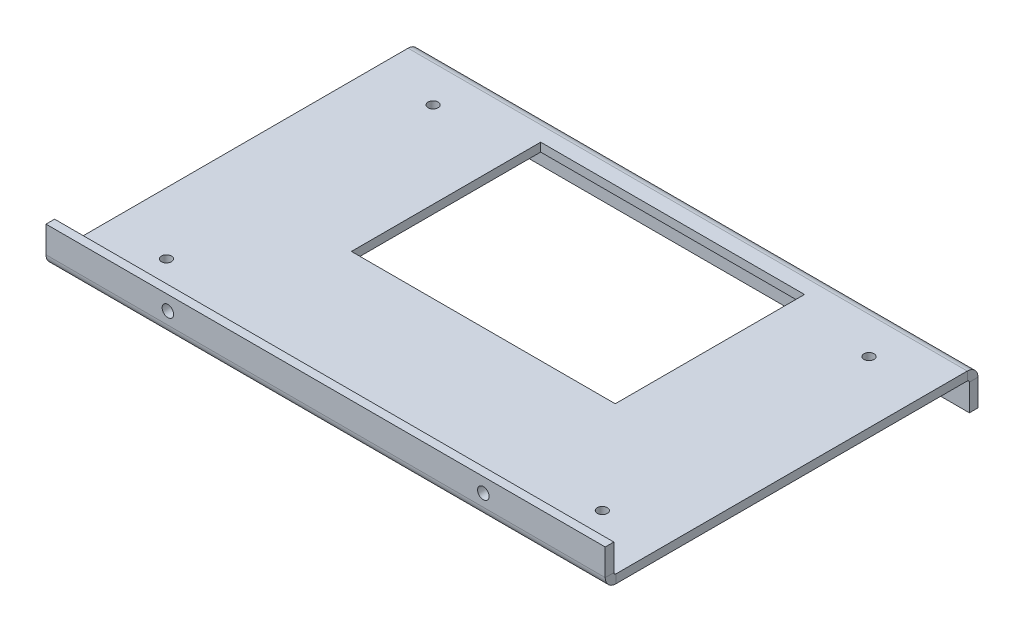
ISO-10303-21;
HEADER;
FILE_DESCRIPTION(('STEP AP214'),'2;1');
FILE_NAME('part.step','',(''),(''),'','','');
FILE_SCHEMA(('AUTOMOTIVE_DESIGN { 1 0 10303 214 1 1 1 1 }'));
ENDSEC;
DATA;
#1=APPLICATION_CONTEXT('core data for automotive mechanical design processes');
#2=APPLICATION_PROTOCOL_DEFINITION('international standard','automotive_design',2000,#1);
#3=PRODUCT_CONTEXT('',#1,'mechanical');
#4=PRODUCT('Part','Part','',(#3));
#5=PRODUCT_RELATED_PRODUCT_CATEGORY('part','',(#4));
#6=PRODUCT_DEFINITION_FORMATION('','',#4);
#7=PRODUCT_DEFINITION_CONTEXT('part definition',#1,'design');
#8=PRODUCT_DEFINITION('design','',#6,#7);
#9=PRODUCT_DEFINITION_SHAPE('','',#8);
#10=(LENGTH_UNIT() NAMED_UNIT(*) SI_UNIT(.MILLI.,.METRE.));
#11=(NAMED_UNIT(*) PLANE_ANGLE_UNIT() SI_UNIT($,.RADIAN.));
#12=(NAMED_UNIT(*) SI_UNIT($,.STERADIAN.) SOLID_ANGLE_UNIT());
#13=UNCERTAINTY_MEASURE_WITH_UNIT(LENGTH_MEASURE(1.E-05),#10,'distance_accuracy_value','');
#14=(GEOMETRIC_REPRESENTATION_CONTEXT(3) GLOBAL_UNCERTAINTY_ASSIGNED_CONTEXT((#13)) GLOBAL_UNIT_ASSIGNED_CONTEXT((#10,
#11,#12)) REPRESENTATION_CONTEXT('',''));
#15=CARTESIAN_POINT('',(0.,0.,0.));
#16=DIRECTION('',(0.,0.,1.));
#17=DIRECTION('',(1.,0.,0.));
#18=AXIS2_PLACEMENT_3D('',#15,#16,#17);
#19=CARTESIAN_POINT('',(97.5,-3.,65.));
#20=DIRECTION('',(1.,0.,0.));
#21=DIRECTION('',(0.,0.,-1.));
#22=AXIS2_PLACEMENT_3D('',#19,#20,#21);
#23=PLANE('',#22);
#24=DIRECTION('',(0.,0.,-1.));
#25=VECTOR('',#24,1.);
#26=CARTESIAN_POINT('',(97.5,-3.,65.));
#27=LINE('',#26,#25);
#28=CARTESIAN_POINT('',(97.5,-2.99999999999999,61.2634));
#29=VERTEX_POINT('',#28);
#30=CARTESIAN_POINT('',(97.5,-3.,-61.2634));
#31=VERTEX_POINT('',#30);
#32=EDGE_CURVE('E90',#29,#31,#27,.T.);
#33=ORIENTED_EDGE('',*,*,#32,.T.);
#34=DIRECTION('',(0.,1.,0.));
#35=VECTOR('',#34,1.);
#36=CARTESIAN_POINT('',(97.5,-3.00000000000001,-61.2634));
#37=LINE('',#36,#35);
#38=CARTESIAN_POINT('',(97.5,0.,-61.2634));
#39=VERTEX_POINT('',#38);
#40=EDGE_CURVE('E321',#31,#39,#37,.T.);
#41=ORIENTED_EDGE('',*,*,#40,.T.);
#42=DIRECTION('',(0.,0.,-1.));
#43=VECTOR('',#42,1.);
#44=CARTESIAN_POINT('',(97.5,0.,65.));
#45=LINE('',#44,#43);
#46=CARTESIAN_POINT('',(97.5,0.,61.2634));
#47=VERTEX_POINT('',#46);
#48=EDGE_CURVE('E414',#47,#39,#45,.T.);
#49=ORIENTED_EDGE('',*,*,#48,.F.);
#50=DIRECTION('',(0.,-1.,0.));
#51=VECTOR('',#50,1.);
#52=CARTESIAN_POINT('',(97.5,0.,61.2634));
#53=LINE('',#52,#51);
#54=EDGE_CURVE('E395',#47,#29,#53,.T.);
#55=ORIENTED_EDGE('',*,*,#54,.T.);
#56=EDGE_LOOP('',(#33,#41,#49,#55));
#57=FACE_BOUND('',#56,.T.);
#58=ADVANCED_FACE('F81',(#57),#23,.T.);
#59=CARTESIAN_POINT('',(0.,-3.,0.));
#60=DIRECTION('',(0.,-1.,0.));
#61=DIRECTION('',(0.,0.,-1.));
#62=AXIS2_PLACEMENT_3D('',#59,#60,#61);
#63=PLANE('',#62);
#64=DIRECTION('',(0.,0.,1.));
#65=VECTOR('',#64,1.);
#66=CARTESIAN_POINT('',(-46.,-3.,9.99999999999999));
#67=LINE('',#66,#65);
#68=CARTESIAN_POINT('',(-46.,-3.,-56.));
#69=VERTEX_POINT('',#68);
#70=CARTESIAN_POINT('',(-46.,-3.,9.99999999999999));
#71=VERTEX_POINT('',#70);
#72=EDGE_CURVE('E206',#69,#71,#67,.T.);
#73=ORIENTED_EDGE('',*,*,#72,.T.);
#74=DIRECTION('',(1.,0.,0.));
#75=VECTOR('',#74,1.);
#76=CARTESIAN_POINT('',(46.,-3.,9.99999999999998));
#77=LINE('',#76,#75);
#78=CARTESIAN_POINT('',(46.,-3.,9.99999999999998));
#79=VERTEX_POINT('',#78);
#80=EDGE_CURVE('E194',#71,#79,#77,.T.);
#81=ORIENTED_EDGE('',*,*,#80,.T.);
#82=DIRECTION('',(0.,0.,-1.));
#83=VECTOR('',#82,1.);
#84=CARTESIAN_POINT('',(46.,-3.,9.99999999999998));
#85=LINE('',#84,#83);
#86=CARTESIAN_POINT('',(46.,-3.,-56.));
#87=VERTEX_POINT('',#86);
#88=EDGE_CURVE('E221',#79,#87,#85,.T.);
#89=ORIENTED_EDGE('',*,*,#88,.T.);
#90=DIRECTION('',(-1.,0.,0.));
#91=VECTOR('',#90,1.);
#92=CARTESIAN_POINT('',(46.,-3.,-56.));
#93=LINE('',#92,#91);
#94=EDGE_CURVE('E214',#87,#69,#93,.T.);
#95=ORIENTED_EDGE('',*,*,#94,.T.);
#96=EDGE_LOOP('',(#73,#81,#89,#95));
#97=FACE_BOUND('',#96,.T.);
#98=CARTESIAN_POINT('',(-76.,-3.,44.5));
#99=DIRECTION('',(0.,-1.,0.));
#100=DIRECTION('',(0.,0.,-1.));
#101=AXIS2_PLACEMENT_3D('',#98,#99,#100);
#102=CIRCLE('',#101,1.74999999999998);
#103=CARTESIAN_POINT('',(-76.,-3.,42.75));
#104=VERTEX_POINT('',#103);
#105=EDGE_CURVE('E202',#104,#104,#102,.F.);
#106=ORIENTED_EDGE('',*,*,#105,.T.);
#107=EDGE_LOOP('',(#106));
#108=FACE_BOUND('',#107,.T.);
#109=CARTESIAN_POINT('',(75.9999999999999,-3.,44.5));
#110=DIRECTION('',(0.,-1.,0.));
#111=DIRECTION('',(0.,0.,-1.));
#112=AXIS2_PLACEMENT_3D('',#109,#110,#111);
#113=CIRCLE('',#112,1.75);
#114=CARTESIAN_POINT('',(75.9999999999999,-3.,42.75));
#115=VERTEX_POINT('',#114);
#116=EDGE_CURVE('E840',#115,#115,#113,.F.);
#117=ORIENTED_EDGE('',*,*,#116,.T.);
#118=EDGE_LOOP('',(#117));
#119=FACE_BOUND('',#118,.T.);
#120=CARTESIAN_POINT('',(76.,-3.,-48.5));
#121=DIRECTION('',(0.,-1.,0.));
#122=DIRECTION('',(0.,0.,-1.));
#123=AXIS2_PLACEMENT_3D('',#120,#121,#122);
#124=CIRCLE('',#123,1.75);
#125=CARTESIAN_POINT('',(76.,-3.,-50.25));
#126=VERTEX_POINT('',#125);
#127=EDGE_CURVE('E848',#126,#126,#124,.F.);
#128=ORIENTED_EDGE('',*,*,#127,.T.);
#129=EDGE_LOOP('',(#128));
#130=FACE_BOUND('',#129,.T.);
#131=CARTESIAN_POINT('',(-76.,-3.,-48.5));
#132=DIRECTION('',(0.,-1.,0.));
#133=DIRECTION('',(0.,0.,-1.));
#134=AXIS2_PLACEMENT_3D('',#131,#132,#133);
#135=CIRCLE('',#134,1.75);
#136=CARTESIAN_POINT('',(-76.,-3.,-50.25));
#137=VERTEX_POINT('',#136);
#138=EDGE_CURVE('E246',#137,#137,#135,.F.);
#139=ORIENTED_EDGE('',*,*,#138,.T.);
#140=EDGE_LOOP('',(#139));
#141=FACE_BOUND('',#140,.T.);
#142=DIRECTION('',(0.,0.,1.));
#143=VECTOR('',#142,1.);
#144=CARTESIAN_POINT('',(-97.5,-3.,65.));
#145=LINE('',#144,#143);
#146=CARTESIAN_POINT('',(-97.5,-3.,-61.2634));
#147=VERTEX_POINT('',#146);
#148=CARTESIAN_POINT('',(-97.5,-3.,61.2634));
#149=VERTEX_POINT('',#148);
#150=EDGE_CURVE('E13',#147,#149,#145,.T.);
#151=ORIENTED_EDGE('',*,*,#150,.F.);
#152=DIRECTION('',(1.,0.,0.));
#153=VECTOR('',#152,1.);
#154=CARTESIAN_POINT('',(97.5,-3.00000000000001,-61.2634));
#155=LINE('',#154,#153);
#156=EDGE_CURVE('E329',#31,#147,#155,.F.);
#157=ORIENTED_EDGE('',*,*,#156,.F.);
#158=ORIENTED_EDGE('',*,*,#32,.F.);
#159=DIRECTION('',(1.,0.,0.));
#160=VECTOR('',#159,1.);
#161=CARTESIAN_POINT('',(97.4999999999999,-2.99999999999999,61.2634));
#162=LINE('',#161,#160);
#163=EDGE_CURVE('E386',#29,#149,#162,.F.);
#164=ORIENTED_EDGE('',*,*,#163,.T.);
#165=EDGE_LOOP('',(#151,#157,#158,#164));
#166=FACE_BOUND('',#165,.T.);
#167=ADVANCED_FACE('F212',(#97,#108,#119,#130,#141,#166),#63,.T.);
#168=CARTESIAN_POINT('',(0.,0.,0.));
#169=DIRECTION('',(0.,-1.,0.));
#170=DIRECTION('',(0.,0.,-1.));
#171=AXIS2_PLACEMENT_3D('',#168,#169,#170);
#172=PLANE('',#171);
#173=DIRECTION('',(1.,0.,0.));
#174=VECTOR('',#173,1.);
#175=CARTESIAN_POINT('',(46.,0.,9.99999999999998));
#176=LINE('',#175,#174);
#177=CARTESIAN_POINT('',(-46.,0.,9.99999999999999));
#178=VERTEX_POINT('',#177);
#179=CARTESIAN_POINT('',(46.,0.,9.99999999999998));
#180=VERTEX_POINT('',#179);
#181=EDGE_CURVE('E219',#178,#180,#176,.T.);
#182=ORIENTED_EDGE('',*,*,#181,.F.);
#183=DIRECTION('',(0.,0.,1.));
#184=VECTOR('',#183,1.);
#185=CARTESIAN_POINT('',(-46.,0.,9.99999999999999));
#186=LINE('',#185,#184);
#187=CARTESIAN_POINT('',(-46.,0.,-56.));
#188=VERTEX_POINT('',#187);
#189=EDGE_CURVE('E106',#188,#178,#186,.T.);
#190=ORIENTED_EDGE('',*,*,#189,.F.);
#191=DIRECTION('',(-1.,0.,0.));
#192=VECTOR('',#191,1.);
#193=CARTESIAN_POINT('',(46.,0.,-56.));
#194=LINE('',#193,#192);
#195=CARTESIAN_POINT('',(46.,0.,-56.));
#196=VERTEX_POINT('',#195);
#197=EDGE_CURVE('E209',#196,#188,#194,.T.);
#198=ORIENTED_EDGE('',*,*,#197,.F.);
#199=DIRECTION('',(0.,0.,-1.));
#200=VECTOR('',#199,1.);
#201=CARTESIAN_POINT('',(46.,0.,9.99999999999998));
#202=LINE('',#201,#200);
#203=EDGE_CURVE('E227',#180,#196,#202,.T.);
#204=ORIENTED_EDGE('',*,*,#203,.F.);
#205=EDGE_LOOP('',(#182,#190,#198,#204));
#206=FACE_BOUND('',#205,.T.);
#207=CARTESIAN_POINT('',(-76.,0.,44.5));
#208=DIRECTION('',(0.,1.,0.));
#209=DIRECTION('',(0.,0.,-1.));
#210=AXIS2_PLACEMENT_3D('',#207,#208,#209);
#211=CIRCLE('',#210,1.74999999999998);
#212=CARTESIAN_POINT('',(-76.,0.,42.75));
#213=VERTEX_POINT('',#212);
#214=EDGE_CURVE('E836',#213,#213,#211,.T.);
#215=ORIENTED_EDGE('',*,*,#214,.F.);
#216=EDGE_LOOP('',(#215));
#217=FACE_BOUND('',#216,.T.);
#218=CARTESIAN_POINT('',(75.9999999999999,0.,44.5));
#219=DIRECTION('',(0.,1.,0.));
#220=DIRECTION('',(0.,0.,1.));
#221=AXIS2_PLACEMENT_3D('',#218,#219,#220);
#222=CIRCLE('',#221,1.75);
#223=CARTESIAN_POINT('',(75.9999999999999,0.,46.25));
#224=VERTEX_POINT('',#223);
#225=EDGE_CURVE('E844',#224,#224,#222,.T.);
#226=ORIENTED_EDGE('',*,*,#225,.F.);
#227=EDGE_LOOP('',(#226));
#228=FACE_BOUND('',#227,.T.);
#229=CARTESIAN_POINT('',(76.,0.,-48.5));
#230=DIRECTION('',(0.,1.,0.));
#231=DIRECTION('',(0.,0.,-1.));
#232=AXIS2_PLACEMENT_3D('',#229,#230,#231);
#233=CIRCLE('',#232,1.75);
#234=CARTESIAN_POINT('',(76.,0.,-50.25));
#235=VERTEX_POINT('',#234);
#236=EDGE_CURVE('E250',#235,#235,#233,.T.);
#237=ORIENTED_EDGE('',*,*,#236,.F.);
#238=EDGE_LOOP('',(#237));
#239=FACE_BOUND('',#238,.T.);
#240=CARTESIAN_POINT('',(-76.,0.,-48.5));
#241=DIRECTION('',(0.,1.,0.));
#242=DIRECTION('',(0.,0.,1.));
#243=AXIS2_PLACEMENT_3D('',#240,#241,#242);
#244=CIRCLE('',#243,1.75);
#245=CARTESIAN_POINT('',(-76.,0.,-46.75));
#246=VERTEX_POINT('',#245);
#247=EDGE_CURVE('E241',#246,#246,#244,.T.);
#248=ORIENTED_EDGE('',*,*,#247,.F.);
#249=EDGE_LOOP('',(#248));
#250=FACE_BOUND('',#249,.T.);
#251=DIRECTION('',(1.,0.,0.));
#252=VECTOR('',#251,1.);
#253=CARTESIAN_POINT('',(97.5,0.,-61.2634));
#254=LINE('',#253,#252);
#255=CARTESIAN_POINT('',(-97.5,0.,-61.2634));
#256=VERTEX_POINT('',#255);
#257=EDGE_CURVE('E312',#39,#256,#254,.F.);
#258=ORIENTED_EDGE('',*,*,#257,.T.);
#259=DIRECTION('',(0.,0.,1.));
#260=VECTOR('',#259,1.);
#261=CARTESIAN_POINT('',(-97.5,0.,65.));
#262=LINE('',#261,#260);
#263=CARTESIAN_POINT('',(-97.5,0.,61.2634));
#264=VERTEX_POINT('',#263);
#265=EDGE_CURVE('E420',#256,#264,#262,.T.);
#266=ORIENTED_EDGE('',*,*,#265,.T.);
#267=DIRECTION('',(1.,0.,0.));
#268=VECTOR('',#267,1.);
#269=CARTESIAN_POINT('',(97.4999999999999,0.,61.2634));
#270=LINE('',#269,#268);
#271=EDGE_CURVE('E403',#47,#264,#270,.F.);
#272=ORIENTED_EDGE('',*,*,#271,.F.);
#273=ORIENTED_EDGE('',*,*,#48,.T.);
#274=EDGE_LOOP('',(#258,#266,#272,#273));
#275=FACE_BOUND('',#274,.T.);
#276=ADVANCED_FACE('F493',(#206,#217,#228,#239,#250,#275),#172,.F.);
#277=CARTESIAN_POINT('',(-97.5,-3.,65.));
#278=DIRECTION('',(-1.,0.,0.));
#279=DIRECTION('',(0.,0.,1.));
#280=AXIS2_PLACEMENT_3D('',#277,#278,#279);
#281=PLANE('',#280);
#282=DIRECTION('',(0.,1.,0.));
#283=VECTOR('',#282,1.);
#284=CARTESIAN_POINT('',(-97.5,-3.00000000000001,-61.2634));
#285=LINE('',#284,#283);
#286=EDGE_CURVE('E336',#147,#256,#285,.T.);
#287=ORIENTED_EDGE('',*,*,#286,.F.);
#288=ORIENTED_EDGE('',*,*,#150,.T.);
#289=DIRECTION('',(0.,-1.,0.));
#290=VECTOR('',#289,1.);
#291=CARTESIAN_POINT('',(-97.5,0.,61.2634));
#292=LINE('',#291,#290);
#293=EDGE_CURVE('E410',#264,#149,#292,.T.);
#294=ORIENTED_EDGE('',*,*,#293,.F.);
#295=ORIENTED_EDGE('',*,*,#265,.F.);
#296=EDGE_LOOP('',(#287,#288,#294,#295));
#297=FACE_BOUND('',#296,.T.);
#298=ADVANCED_FACE('F504',(#297),#281,.T.);
#299=CARTESIAN_POINT('',(-97.5,0.736600000000004,61.2634));
#300=DIRECTION('',(-1.,0.,0.));
#301=DIRECTION('',(0.,0.,1.));
#302=AXIS2_PLACEMENT_3D('',#299,#300,#301);
#303=PLANE('',#302);
#304=DIRECTION('',(0.,0.,-1.));
#305=VECTOR('',#304,1.);
#306=CARTESIAN_POINT('',(-97.5,0.736600000000004,65.));
#307=LINE('',#306,#305);
#308=CARTESIAN_POINT('',(-97.5,0.736600000000004,62.));
#309=VERTEX_POINT('',#308);
#310=CARTESIAN_POINT('',(-97.4999999999999,0.736600000000004,65.));
#311=VERTEX_POINT('',#310);
#312=EDGE_CURVE('E340',#309,#311,#307,.F.);
#313=ORIENTED_EDGE('',*,*,#312,.F.);
#314=CARTESIAN_POINT('',(-97.5,0.736600000000004,61.2634));
#315=DIRECTION('',(1.,0.,0.));
#316=DIRECTION('',(0.,0.,-1.));
#317=AXIS2_PLACEMENT_3D('',#314,#315,#316);
#318=CIRCLE('',#317,0.736599999999997);
#319=EDGE_CURVE('E399',#264,#309,#318,.F.);
#320=ORIENTED_EDGE('',*,*,#319,.F.);
#321=ORIENTED_EDGE('',*,*,#293,.T.);
#322=CARTESIAN_POINT('',(-97.4999999999999,0.736600000000004,61.2634));
#323=DIRECTION('',(1.,0.,0.));
#324=DIRECTION('',(0.,0.,-1.));
#325=AXIS2_PLACEMENT_3D('',#322,#323,#324);
#326=CIRCLE('',#325,3.7366);
#327=EDGE_CURVE('E390',#149,#311,#326,.F.);
#328=ORIENTED_EDGE('',*,*,#327,.T.);
#329=EDGE_LOOP('',(#313,#320,#321,#328));
#330=FACE_BOUND('',#329,.T.);
#331=ADVANCED_FACE('F510',(#330),#303,.T.);
#332=CARTESIAN_POINT('',(97.5,0.736600000000004,61.2634));
#333=DIRECTION('',(-1.,0.,0.));
#334=DIRECTION('',(0.,0.,1.));
#335=AXIS2_PLACEMENT_3D('',#332,#333,#334);
#336=PLANE('',#335);
#337=CARTESIAN_POINT('',(97.5,0.736600000000004,61.2634));
#338=DIRECTION('',(1.,0.,0.));
#339=DIRECTION('',(0.,0.,-1.));
#340=AXIS2_PLACEMENT_3D('',#337,#338,#339);
#341=CIRCLE('',#340,0.736599999999997);
#342=CARTESIAN_POINT('',(97.5,0.736600000000004,62.));
#343=VERTEX_POINT('',#342);
#344=EDGE_CURVE('E348',#343,#47,#341,.T.);
#345=ORIENTED_EDGE('',*,*,#344,.F.);
#346=DIRECTION('',(0.,0.,-1.));
#347=VECTOR('',#346,1.);
#348=CARTESIAN_POINT('',(97.5,0.736600000000004,62.));
#349=LINE('',#348,#347);
#350=CARTESIAN_POINT('',(97.5,0.736600000000004,65.));
#351=VERTEX_POINT('',#350);
#352=EDGE_CURVE('E376',#343,#351,#349,.F.);
#353=ORIENTED_EDGE('',*,*,#352,.T.);
#354=CARTESIAN_POINT('',(97.5,0.736600000000004,61.2634));
#355=DIRECTION('',(1.,0.,0.));
#356=DIRECTION('',(0.,0.,-1.));
#357=AXIS2_PLACEMENT_3D('',#354,#355,#356);
#358=CIRCLE('',#357,3.7366);
#359=EDGE_CURVE('E391',#351,#29,#358,.T.);
#360=ORIENTED_EDGE('',*,*,#359,.T.);
#361=ORIENTED_EDGE('',*,*,#54,.F.);
#362=EDGE_LOOP('',(#345,#353,#360,#361));
#363=FACE_BOUND('',#362,.T.);
#364=ADVANCED_FACE('F534',(#363),#336,.F.);
#365=CARTESIAN_POINT('',(97.4999999999999,0.736600000000004,61.2634));
#366=DIRECTION('',(1.,0.,0.));
#367=DIRECTION('',(0.,0.,1.));
#368=AXIS2_PLACEMENT_3D('',#365,#366,#367);
#369=CYLINDRICAL_SURFACE('',#368,3.7366);
#370=ORIENTED_EDGE('',*,*,#163,.F.);
#371=ORIENTED_EDGE('',*,*,#359,.F.);
#372=DIRECTION('',(1.,0.,0.));
#373=VECTOR('',#372,1.);
#374=CARTESIAN_POINT('',(-97.5,0.736600000000004,65.));
#375=LINE('',#374,#373);
#376=EDGE_CURVE('E373',#351,#311,#375,.F.);
#377=ORIENTED_EDGE('',*,*,#376,.T.);
#378=ORIENTED_EDGE('',*,*,#327,.F.);
#379=EDGE_LOOP('',(#370,#371,#377,#378));
#380=FACE_BOUND('',#379,.T.);
#381=ADVANCED_FACE('F506',(#380),#369,.T.);
#382=CARTESIAN_POINT('',(97.4999999999999,0.736600000000004,61.2634));
#383=DIRECTION('',(1.,0.,0.));
#384=DIRECTION('',(0.,0.,1.));
#385=AXIS2_PLACEMENT_3D('',#382,#383,#384);
#386=CYLINDRICAL_SURFACE('',#385,0.736599999999997);
#387=ORIENTED_EDGE('',*,*,#271,.T.);
#388=ORIENTED_EDGE('',*,*,#319,.T.);
#389=DIRECTION('',(1.,0.,0.));
#390=VECTOR('',#389,1.);
#391=CARTESIAN_POINT('',(-97.5,0.736600000000004,62.));
#392=LINE('',#391,#390);
#393=EDGE_CURVE('E380',#309,#343,#392,.T.);
#394=ORIENTED_EDGE('',*,*,#393,.T.);
#395=ORIENTED_EDGE('',*,*,#344,.T.);
#396=EDGE_LOOP('',(#387,#388,#394,#395));
#397=FACE_BOUND('',#396,.T.);
#398=ADVANCED_FACE('F513',(#397),#386,.F.);
#399=CARTESIAN_POINT('',(97.5,10.,65.));
#400=DIRECTION('',(-1.,0.,0.));
#401=DIRECTION('',(0.,-1.,0.));
#402=AXIS2_PLACEMENT_3D('',#399,#400,#401);
#403=PLANE('',#402);
#404=ORIENTED_EDGE('',*,*,#352,.F.);
#405=DIRECTION('',(0.,-1.,0.));
#406=VECTOR('',#405,1.);
#407=CARTESIAN_POINT('',(97.5,10.,62.));
#408=LINE('',#407,#406);
#409=CARTESIAN_POINT('',(97.5,10.,62.));
#410=VERTEX_POINT('',#409);
#411=EDGE_CURVE('E370',#343,#410,#408,.F.);
#412=ORIENTED_EDGE('',*,*,#411,.T.);
#413=DIRECTION('',(0.,0.,-1.));
#414=VECTOR('',#413,1.);
#415=CARTESIAN_POINT('',(97.5,10.,65.));
#416=LINE('',#415,#414);
#417=CARTESIAN_POINT('',(97.5,10.,65.));
#418=VERTEX_POINT('',#417);
#419=EDGE_CURVE('E344',#418,#410,#416,.T.);
#420=ORIENTED_EDGE('',*,*,#419,.F.);
#421=DIRECTION('',(0.,1.,0.));
#422=VECTOR('',#421,1.);
#423=CARTESIAN_POINT('',(97.5,-4.05925293378573E-13,65.));
#424=LINE('',#423,#422);
#425=EDGE_CURVE('E360',#351,#418,#424,.T.);
#426=ORIENTED_EDGE('',*,*,#425,.F.);
#427=EDGE_LOOP('',(#404,#412,#420,#426));
#428=FACE_BOUND('',#427,.T.);
#429=ADVANCED_FACE('F532',(#428),#403,.F.);
#430=CARTESIAN_POINT('',(-97.5,0.,65.));
#431=DIRECTION('',(1.,0.,0.));
#432=DIRECTION('',(0.,1.,0.));
#433=AXIS2_PLACEMENT_3D('',#430,#431,#432);
#434=PLANE('',#433);
#435=ORIENTED_EDGE('',*,*,#312,.T.);
#436=DIRECTION('',(0.,-1.,0.));
#437=VECTOR('',#436,1.);
#438=CARTESIAN_POINT('',(-97.5,5.41233724504764E-13,65.));
#439=LINE('',#438,#437);
#440=CARTESIAN_POINT('',(-97.5,10.,65.));
#441=VERTEX_POINT('',#440);
#442=EDGE_CURVE('E353',#441,#311,#439,.T.);
#443=ORIENTED_EDGE('',*,*,#442,.F.);
#444=DIRECTION('',(0.,0.,-1.));
#445=VECTOR('',#444,1.);
#446=CARTESIAN_POINT('',(-97.5,10.,65.));
#447=LINE('',#446,#445);
#448=CARTESIAN_POINT('',(-97.5,10.,62.));
#449=VERTEX_POINT('',#448);
#450=EDGE_CURVE('E349',#441,#449,#447,.T.);
#451=ORIENTED_EDGE('',*,*,#450,.T.);
#452=DIRECTION('',(0.,1.,0.));
#453=VECTOR('',#452,1.);
#454=CARTESIAN_POINT('',(-97.5,0.,62.));
#455=LINE('',#454,#453);
#456=EDGE_CURVE('E363',#449,#309,#455,.F.);
#457=ORIENTED_EDGE('',*,*,#456,.T.);
#458=EDGE_LOOP('',(#435,#443,#451,#457));
#459=FACE_BOUND('',#458,.T.);
#460=ADVANCED_FACE('F522',(#459),#434,.F.);
#461=CARTESIAN_POINT('',(0.,0.,65.));
#462=DIRECTION('',(0.,0.,-1.));
#463=DIRECTION('',(-1.,0.,0.));
#464=AXIS2_PLACEMENT_3D('',#461,#462,#463);
#465=PLANE('',#464);
#466=CARTESIAN_POINT('',(-55.,5.00000000000001,65.));
#467=DIRECTION('',(0.,0.,1.));
#468=DIRECTION('',(1.,0.,0.));
#469=AXIS2_PLACEMENT_3D('',#466,#467,#468);
#470=CIRCLE('',#469,2.);
#471=CARTESIAN_POINT('',(-53.,5.00000000000001,65.));
#472=VERTEX_POINT('',#471);
#473=EDGE_CURVE('E259',#472,#472,#470,.T.);
#474=ORIENTED_EDGE('',*,*,#473,.F.);
#475=EDGE_LOOP('',(#474));
#476=FACE_BOUND('',#475,.T.);
#477=CARTESIAN_POINT('',(55.,5.00000000000002,65.));
#478=DIRECTION('',(0.,0.,1.));
#479=DIRECTION('',(-1.,0.,0.));
#480=AXIS2_PLACEMENT_3D('',#477,#478,#479);
#481=CIRCLE('',#480,2.);
#482=CARTESIAN_POINT('',(53.,5.00000000000002,65.));
#483=VERTEX_POINT('',#482);
#484=EDGE_CURVE('E264',#483,#483,#481,.T.);
#485=ORIENTED_EDGE('',*,*,#484,.F.);
#486=EDGE_LOOP('',(#485));
#487=FACE_BOUND('',#486,.T.);
#488=ORIENTED_EDGE('',*,*,#376,.F.);
#489=ORIENTED_EDGE('',*,*,#425,.T.);
#490=DIRECTION('',(-1.,0.,0.));
#491=VECTOR('',#490,1.);
#492=CARTESIAN_POINT('',(0.,10.,65.));
#493=LINE('',#492,#491);
#494=EDGE_CURVE('E357',#418,#441,#493,.T.);
#495=ORIENTED_EDGE('',*,*,#494,.T.);
#496=ORIENTED_EDGE('',*,*,#442,.T.);
#497=EDGE_LOOP('',(#488,#489,#495,#496));
#498=FACE_BOUND('',#497,.T.);
#499=ADVANCED_FACE('F536',(#476,#487,#498),#465,.F.);
#500=CARTESIAN_POINT('',(0.,0.,62.));
#501=DIRECTION('',(0.,0.,-1.));
#502=DIRECTION('',(-1.,0.,0.));
#503=AXIS2_PLACEMENT_3D('',#500,#501,#502);
#504=PLANE('',#503);
#505=CARTESIAN_POINT('',(-55.,5.00000000000001,62.));
#506=DIRECTION('',(0.,0.,-1.));
#507=DIRECTION('',(-1.,0.,0.));
#508=AXIS2_PLACEMENT_3D('',#505,#506,#507);
#509=CIRCLE('',#508,2.);
#510=CARTESIAN_POINT('',(-57.,5.00000000000001,62.));
#511=VERTEX_POINT('',#510);
#512=EDGE_CURVE('E311',#511,#511,#509,.T.);
#513=ORIENTED_EDGE('',*,*,#512,.F.);
#514=EDGE_LOOP('',(#513));
#515=FACE_BOUND('',#514,.T.);
#516=CARTESIAN_POINT('',(55.,5.00000000000002,62.));
#517=DIRECTION('',(0.,0.,-1.));
#518=DIRECTION('',(-1.,0.,0.));
#519=AXIS2_PLACEMENT_3D('',#516,#517,#518);
#520=CIRCLE('',#519,2.);
#521=CARTESIAN_POINT('',(53.,5.00000000000002,62.));
#522=VERTEX_POINT('',#521);
#523=EDGE_CURVE('E263',#522,#522,#520,.T.);
#524=ORIENTED_EDGE('',*,*,#523,.F.);
#525=EDGE_LOOP('',(#524));
#526=FACE_BOUND('',#525,.T.);
#527=ORIENTED_EDGE('',*,*,#411,.F.);
#528=ORIENTED_EDGE('',*,*,#393,.F.);
#529=ORIENTED_EDGE('',*,*,#456,.F.);
#530=DIRECTION('',(1.,0.,0.));
#531=VECTOR('',#530,1.);
#532=CARTESIAN_POINT('',(-97.5,10.,62.));
#533=LINE('',#532,#531);
#534=EDGE_CURVE('E367',#410,#449,#533,.F.);
#535=ORIENTED_EDGE('',*,*,#534,.F.);
#536=EDGE_LOOP('',(#527,#528,#529,#535));
#537=FACE_BOUND('',#536,.T.);
#538=ADVANCED_FACE('F519',(#515,#526,#537),#504,.T.);
#539=CARTESIAN_POINT('',(-97.5,10.,65.));
#540=DIRECTION('',(0.,-1.,0.));
#541=DIRECTION('',(0.,0.,-1.));
#542=AXIS2_PLACEMENT_3D('',#539,#540,#541);
#543=PLANE('',#542);
#544=ORIENTED_EDGE('',*,*,#534,.T.);
#545=ORIENTED_EDGE('',*,*,#450,.F.);
#546=ORIENTED_EDGE('',*,*,#494,.F.);
#547=ORIENTED_EDGE('',*,*,#419,.T.);
#548=EDGE_LOOP('',(#544,#545,#546,#547));
#549=FACE_BOUND('',#548,.T.);
#550=ADVANCED_FACE('F527',(#549),#543,.F.);
#551=CARTESIAN_POINT('',(-97.5,-3.73660000000001,-61.2634));
#552=DIRECTION('',(-1.,0.,0.));
#553=DIRECTION('',(0.,0.,1.));
#554=AXIS2_PLACEMENT_3D('',#551,#552,#553);
#555=PLANE('',#554);
#556=DIRECTION('',(0.,0.,1.));
#557=VECTOR('',#556,1.);
#558=CARTESIAN_POINT('',(-97.5,-3.73659999999999,-65.));
#559=LINE('',#558,#557);
#560=CARTESIAN_POINT('',(-97.5,-3.73660000000001,-62.));
#561=VERTEX_POINT('',#560);
#562=CARTESIAN_POINT('',(-97.5,-3.7366,-65.));
#563=VERTEX_POINT('',#562);
#564=EDGE_CURVE('E307',#561,#563,#559,.F.);
#565=ORIENTED_EDGE('',*,*,#564,.F.);
#566=CARTESIAN_POINT('',(-97.5,-3.73660000000001,-61.2634));
#567=DIRECTION('',(1.,0.,0.));
#568=DIRECTION('',(0.,0.,-1.));
#569=AXIS2_PLACEMENT_3D('',#566,#567,#568);
#570=CIRCLE('',#569,0.736599999999997);
#571=EDGE_CURVE('E325',#147,#561,#570,.F.);
#572=ORIENTED_EDGE('',*,*,#571,.F.);
#573=ORIENTED_EDGE('',*,*,#286,.T.);
#574=CARTESIAN_POINT('',(-97.5,-3.73660000000001,-61.2634));
#575=DIRECTION('',(1.,0.,0.));
#576=DIRECTION('',(0.,0.,-1.));
#577=AXIS2_PLACEMENT_3D('',#574,#575,#576);
#578=CIRCLE('',#577,3.7366);
#579=EDGE_CURVE('E316',#256,#563,#578,.F.);
#580=ORIENTED_EDGE('',*,*,#579,.T.);
#581=EDGE_LOOP('',(#565,#572,#573,#580));
#582=FACE_BOUND('',#581,.T.);
#583=ADVANCED_FACE('F471',(#582),#555,.T.);
#584=CARTESIAN_POINT('',(97.5,-3.73660000000001,-61.2634));
#585=DIRECTION('',(-1.,0.,0.));
#586=DIRECTION('',(0.,0.,1.));
#587=AXIS2_PLACEMENT_3D('',#584,#585,#586);
#588=PLANE('',#587);
#589=CARTESIAN_POINT('',(97.5,-3.73660000000001,-61.2634));
#590=DIRECTION('',(1.,0.,0.));
#591=DIRECTION('',(0.,0.,-1.));
#592=AXIS2_PLACEMENT_3D('',#589,#590,#591);
#593=CIRCLE('',#592,0.736599999999997);
#594=CARTESIAN_POINT('',(97.5,-3.73660000000001,-62.));
#595=VERTEX_POINT('',#594);
#596=EDGE_CURVE('E272',#595,#31,#593,.T.);
#597=ORIENTED_EDGE('',*,*,#596,.F.);
#598=DIRECTION('',(0.,0.,1.));
#599=VECTOR('',#598,1.);
#600=CARTESIAN_POINT('',(97.5,-3.73660000000001,-62.));
#601=LINE('',#600,#599);
#602=CARTESIAN_POINT('',(97.5,-3.73659999999999,-65.));
#603=VERTEX_POINT('',#602);
#604=EDGE_CURVE('E300',#595,#603,#601,.F.);
#605=ORIENTED_EDGE('',*,*,#604,.T.);
#606=CARTESIAN_POINT('',(97.5,-3.73660000000001,-61.2634));
#607=DIRECTION('',(1.,0.,0.));
#608=DIRECTION('',(0.,0.,-1.));
#609=AXIS2_PLACEMENT_3D('',#606,#607,#608);
#610=CIRCLE('',#609,3.7366);
#611=EDGE_CURVE('E317',#603,#39,#610,.T.);
#612=ORIENTED_EDGE('',*,*,#611,.T.);
#613=ORIENTED_EDGE('',*,*,#40,.F.);
#614=EDGE_LOOP('',(#597,#605,#612,#613));
#615=FACE_BOUND('',#614,.T.);
#616=ADVANCED_FACE('F461',(#615),#588,.F.);
#617=CARTESIAN_POINT('',(97.5,-3.73660000000001,-61.2634));
#618=DIRECTION('',(1.,0.,0.));
#619=DIRECTION('',(0.,0.,-1.));
#620=AXIS2_PLACEMENT_3D('',#617,#618,#619);
#621=CYLINDRICAL_SURFACE('',#620,3.7366);
#622=ORIENTED_EDGE('',*,*,#257,.F.);
#623=ORIENTED_EDGE('',*,*,#611,.F.);
#624=DIRECTION('',(1.,0.,0.));
#625=VECTOR('',#624,1.);
#626=CARTESIAN_POINT('',(-97.5,-3.73659999999999,-65.));
#627=LINE('',#626,#625);
#628=EDGE_CURVE('E297',#603,#563,#627,.F.);
#629=ORIENTED_EDGE('',*,*,#628,.T.);
#630=ORIENTED_EDGE('',*,*,#579,.F.);
#631=EDGE_LOOP('',(#622,#623,#629,#630));
#632=FACE_BOUND('',#631,.T.);
#633=ADVANCED_FACE('F469',(#632),#621,.T.);
#634=CARTESIAN_POINT('',(97.5,-3.73660000000001,-61.2634));
#635=DIRECTION('',(1.,0.,0.));
#636=DIRECTION('',(0.,0.,-1.));
#637=AXIS2_PLACEMENT_3D('',#634,#635,#636);
#638=CYLINDRICAL_SURFACE('',#637,0.736599999999997);
#639=ORIENTED_EDGE('',*,*,#156,.T.);
#640=ORIENTED_EDGE('',*,*,#571,.T.);
#641=DIRECTION('',(1.,0.,0.));
#642=VECTOR('',#641,1.);
#643=CARTESIAN_POINT('',(-97.5,-3.73660000000001,-62.));
#644=LINE('',#643,#642);
#645=EDGE_CURVE('E304',#561,#595,#644,.T.);
#646=ORIENTED_EDGE('',*,*,#645,.T.);
#647=ORIENTED_EDGE('',*,*,#596,.T.);
#648=EDGE_LOOP('',(#639,#640,#646,#647));
#649=FACE_BOUND('',#648,.T.);
#650=ADVANCED_FACE('F499',(#649),#638,.F.);
#651=CARTESIAN_POINT('',(97.5,-13.,-65.));
#652=DIRECTION('',(-1.,0.,0.));
#653=DIRECTION('',(0.,-1.,0.));
#654=AXIS2_PLACEMENT_3D('',#651,#652,#653);
#655=PLANE('',#654);
#656=ORIENTED_EDGE('',*,*,#604,.F.);
#657=DIRECTION('',(0.,1.,0.));
#658=VECTOR('',#657,1.);
#659=CARTESIAN_POINT('',(97.5,-13.,-62.));
#660=LINE('',#659,#658);
#661=CARTESIAN_POINT('',(97.5,-13.,-62.));
#662=VERTEX_POINT('',#661);
#663=EDGE_CURVE('E294',#595,#662,#660,.F.);
#664=ORIENTED_EDGE('',*,*,#663,.T.);
#665=DIRECTION('',(0.,0.,1.));
#666=VECTOR('',#665,1.);
#667=CARTESIAN_POINT('',(97.5,-13.,-65.));
#668=LINE('',#667,#666);
#669=CARTESIAN_POINT('',(97.5,-13.,-65.));
#670=VERTEX_POINT('',#669);
#671=EDGE_CURVE('E268',#670,#662,#668,.T.);
#672=ORIENTED_EDGE('',*,*,#671,.F.);
#673=DIRECTION('',(0.,-1.,0.));
#674=VECTOR('',#673,1.);
#675=CARTESIAN_POINT('',(97.4999999999999,6.87016599647484E-13,-65.));
#676=LINE('',#675,#674);
#677=EDGE_CURVE('E284',#603,#670,#676,.T.);
#678=ORIENTED_EDGE('',*,*,#677,.F.);
#679=EDGE_LOOP('',(#656,#664,#672,#678));
#680=FACE_BOUND('',#679,.T.);
#681=ADVANCED_FACE('F456',(#680),#655,.F.);
#682=CARTESIAN_POINT('',(-97.5,-2.99999999999999,-65.));
#683=DIRECTION('',(1.,0.,0.));
#684=DIRECTION('',(0.,1.,0.));
#685=AXIS2_PLACEMENT_3D('',#682,#683,#684);
#686=PLANE('',#685);
#687=ORIENTED_EDGE('',*,*,#564,.T.);
#688=DIRECTION('',(0.,1.,0.));
#689=VECTOR('',#688,1.);
#690=CARTESIAN_POINT('',(-97.5000000000001,-2.60142418235853E-13,-65.));
#691=LINE('',#690,#689);
#692=CARTESIAN_POINT('',(-97.5,-13.,-65.));
#693=VERTEX_POINT('',#692);
#694=EDGE_CURVE('E277',#693,#563,#691,.T.);
#695=ORIENTED_EDGE('',*,*,#694,.F.);
#696=DIRECTION('',(0.,0.,1.));
#697=VECTOR('',#696,1.);
#698=CARTESIAN_POINT('',(-97.5,-13.,-65.));
#699=LINE('',#698,#697);
#700=CARTESIAN_POINT('',(-97.5,-13.,-62.));
#701=VERTEX_POINT('',#700);
#702=EDGE_CURVE('E273',#693,#701,#699,.T.);
#703=ORIENTED_EDGE('',*,*,#702,.T.);
#704=DIRECTION('',(0.,-1.,0.));
#705=VECTOR('',#704,1.);
#706=CARTESIAN_POINT('',(-97.5,-3.,-62.));
#707=LINE('',#706,#705);
#708=EDGE_CURVE('E287',#701,#561,#707,.F.);
#709=ORIENTED_EDGE('',*,*,#708,.T.);
#710=EDGE_LOOP('',(#687,#695,#703,#709));
#711=FACE_BOUND('',#710,.T.);
#712=ADVANCED_FACE('F474',(#711),#686,.F.);
#713=CARTESIAN_POINT('',(0.,2.81091306268911E-13,-65.));
#714=DIRECTION('',(0.,0.,1.));
#715=DIRECTION('',(0.,-1.,0.));
#716=AXIS2_PLACEMENT_3D('',#713,#714,#715);
#717=PLANE('',#716);
#718=CARTESIAN_POINT('',(55.,-7.9999999999999,-65.));
#719=DIRECTION('',(0.,0.,-1.));
#720=DIRECTION('',(0.,1.,0.));
#721=AXIS2_PLACEMENT_3D('',#718,#719,#720);
#722=CIRCLE('',#721,2.);
#723=CARTESIAN_POINT('',(55.,-5.9999999999999,-65.));
#724=VERTEX_POINT('',#723);
#725=EDGE_CURVE('E251',#724,#724,#722,.T.);
#726=ORIENTED_EDGE('',*,*,#725,.F.);
#727=EDGE_LOOP('',(#726));
#728=FACE_BOUND('',#727,.T.);
#729=CARTESIAN_POINT('',(-55.,-7.99999999999989,-65.));
#730=DIRECTION('',(0.,0.,-1.));
#731=DIRECTION('',(0.,-1.,0.));
#732=AXIS2_PLACEMENT_3D('',#729,#730,#731);
#733=CIRCLE('',#732,2.);
#734=CARTESIAN_POINT('',(-55.,-9.99999999999989,-65.));
#735=VERTEX_POINT('',#734);
#736=EDGE_CURVE('E245',#735,#735,#733,.T.);
#737=ORIENTED_EDGE('',*,*,#736,.F.);
#738=EDGE_LOOP('',(#737));
#739=FACE_BOUND('',#738,.T.);
#740=ORIENTED_EDGE('',*,*,#628,.F.);
#741=ORIENTED_EDGE('',*,*,#677,.T.);
#742=DIRECTION('',(-1.,0.,0.));
#743=VECTOR('',#742,1.);
#744=CARTESIAN_POINT('',(0.,-13.,-65.));
#745=LINE('',#744,#743);
#746=EDGE_CURVE('E281',#670,#693,#745,.T.);
#747=ORIENTED_EDGE('',*,*,#746,.T.);
#748=ORIENTED_EDGE('',*,*,#694,.T.);
#749=EDGE_LOOP('',(#740,#741,#747,#748));
#750=FACE_BOUND('',#749,.T.);
#751=ADVANCED_FACE('F446',(#728,#739,#750),#717,.F.);
#752=CARTESIAN_POINT('',(0.,2.70616862252382E-13,-62.));
#753=DIRECTION('',(0.,0.,1.));
#754=DIRECTION('',(0.,-1.,0.));
#755=AXIS2_PLACEMENT_3D('',#752,#753,#754);
#756=PLANE('',#755);
#757=CARTESIAN_POINT('',(55.,-7.99999999999991,-62.));
#758=DIRECTION('',(0.,0.,1.));
#759=DIRECTION('',(0.,-1.,0.));
#760=AXIS2_PLACEMENT_3D('',#757,#758,#759);
#761=CIRCLE('',#760,2.);
#762=CARTESIAN_POINT('',(55.,-9.99999999999991,-62.));
#763=VERTEX_POINT('',#762);
#764=EDGE_CURVE('E84',#763,#763,#761,.T.);
#765=ORIENTED_EDGE('',*,*,#764,.F.);
#766=EDGE_LOOP('',(#765));
#767=FACE_BOUND('',#766,.T.);
#768=CARTESIAN_POINT('',(-55.,-7.9999999999999,-62.));
#769=DIRECTION('',(0.,0.,1.));
#770=DIRECTION('',(0.,-1.,0.));
#771=AXIS2_PLACEMENT_3D('',#768,#769,#770);
#772=CIRCLE('',#771,2.);
#773=CARTESIAN_POINT('',(-55.,-9.9999999999999,-62.));
#774=VERTEX_POINT('',#773);
#775=EDGE_CURVE('E255',#774,#774,#772,.T.);
#776=ORIENTED_EDGE('',*,*,#775,.F.);
#777=EDGE_LOOP('',(#776));
#778=FACE_BOUND('',#777,.T.);
#779=ORIENTED_EDGE('',*,*,#663,.F.);
#780=ORIENTED_EDGE('',*,*,#645,.F.);
#781=ORIENTED_EDGE('',*,*,#708,.F.);
#782=DIRECTION('',(1.,0.,0.));
#783=VECTOR('',#782,1.);
#784=CARTESIAN_POINT('',(-97.5,-13.,-62.));
#785=LINE('',#784,#783);
#786=EDGE_CURVE('E291',#662,#701,#785,.F.);
#787=ORIENTED_EDGE('',*,*,#786,.F.);
#788=EDGE_LOOP('',(#779,#780,#781,#787));
#789=FACE_BOUND('',#788,.T.);
#790=ADVANCED_FACE('F442',(#767,#778,#789),#756,.T.);
#791=CARTESIAN_POINT('',(-97.5,-13.,-65.));
#792=DIRECTION('',(0.,1.,0.));
#793=DIRECTION('',(0.,0.,1.));
#794=AXIS2_PLACEMENT_3D('',#791,#792,#793);
#795=PLANE('',#794);
#796=ORIENTED_EDGE('',*,*,#786,.T.);
#797=ORIENTED_EDGE('',*,*,#702,.F.);
#798=ORIENTED_EDGE('',*,*,#746,.F.);
#799=ORIENTED_EDGE('',*,*,#671,.T.);
#800=EDGE_LOOP('',(#796,#797,#798,#799));
#801=FACE_BOUND('',#800,.T.);
#802=ADVANCED_FACE('F445',(#801),#795,.F.);
#803=CARTESIAN_POINT('',(55.,5.00000000000002,55.));
#804=DIRECTION('',(0.,0.,1.));
#805=DIRECTION('',(1.,0.,0.));
#806=AXIS2_PLACEMENT_3D('',#803,#804,#805);
#807=CYLINDRICAL_SURFACE('',#806,2.);
#808=ORIENTED_EDGE('',*,*,#523,.T.);
#809=EDGE_LOOP('',(#808));
#810=FACE_BOUND('',#809,.T.);
#811=ORIENTED_EDGE('',*,*,#484,.T.);
#812=EDGE_LOOP('',(#811));
#813=FACE_BOUND('',#812,.T.);
#814=ADVANCED_FACE('F478',(#810,#813),#807,.F.);
#815=CARTESIAN_POINT('',(-55.,5.00000000000001,55.));
#816=DIRECTION('',(0.,0.,1.));
#817=DIRECTION('',(1.,0.,0.));
#818=AXIS2_PLACEMENT_3D('',#815,#816,#817);
#819=CYLINDRICAL_SURFACE('',#818,2.);
#820=ORIENTED_EDGE('',*,*,#512,.T.);
#821=EDGE_LOOP('',(#820));
#822=FACE_BOUND('',#821,.T.);
#823=ORIENTED_EDGE('',*,*,#473,.T.);
#824=EDGE_LOOP('',(#823));
#825=FACE_BOUND('',#824,.T.);
#826=ADVANCED_FACE('F483',(#822,#825),#819,.F.);
#827=CARTESIAN_POINT('',(-55.,-7.99999999999992,-55.));
#828=DIRECTION('',(0.,0.,-1.));
#829=DIRECTION('',(0.,1.,0.));
#830=AXIS2_PLACEMENT_3D('',#827,#828,#829);
#831=CYLINDRICAL_SURFACE('',#830,2.);
#832=ORIENTED_EDGE('',*,*,#775,.T.);
#833=EDGE_LOOP('',(#832));
#834=FACE_BOUND('',#833,.T.);
#835=ORIENTED_EDGE('',*,*,#736,.T.);
#836=EDGE_LOOP('',(#835));
#837=FACE_BOUND('',#836,.T.);
#838=ADVANCED_FACE('F710',(#834,#837),#831,.F.);
#839=CARTESIAN_POINT('',(55.,-7.99999999999993,-55.));
#840=DIRECTION('',(0.,0.,-1.));
#841=DIRECTION('',(0.,1.,0.));
#842=AXIS2_PLACEMENT_3D('',#839,#840,#841);
#843=CYLINDRICAL_SURFACE('',#842,2.);
#844=ORIENTED_EDGE('',*,*,#764,.T.);
#845=EDGE_LOOP('',(#844));
#846=FACE_BOUND('',#845,.T.);
#847=ORIENTED_EDGE('',*,*,#725,.T.);
#848=EDGE_LOOP('',(#847));
#849=FACE_BOUND('',#848,.T.);
#850=ADVANCED_FACE('F439',(#846,#849),#843,.F.);
#851=CARTESIAN_POINT('',(-76.,-13.001,-48.5));
#852=DIRECTION('',(0.,1.,0.));
#853=DIRECTION('',(0.,0.,1.));
#854=AXIS2_PLACEMENT_3D('',#851,#852,#853);
#855=CYLINDRICAL_SURFACE('',#854,1.75);
#856=ORIENTED_EDGE('',*,*,#138,.F.);
#857=EDGE_LOOP('',(#856));
#858=FACE_BOUND('',#857,.T.);
#859=ORIENTED_EDGE('',*,*,#247,.T.);
#860=EDGE_LOOP('',(#859));
#861=FACE_BOUND('',#860,.T.);
#862=ADVANCED_FACE('F729',(#858,#861),#855,.F.);
#863=CARTESIAN_POINT('',(76.,-13.001,-48.5));
#864=DIRECTION('',(0.,1.,0.));
#865=DIRECTION('',(0.,0.,1.));
#866=AXIS2_PLACEMENT_3D('',#863,#864,#865);
#867=CYLINDRICAL_SURFACE('',#866,1.75);
#868=ORIENTED_EDGE('',*,*,#127,.F.);
#869=EDGE_LOOP('',(#868));
#870=FACE_BOUND('',#869,.T.);
#871=ORIENTED_EDGE('',*,*,#236,.T.);
#872=EDGE_LOOP('',(#871));
#873=FACE_BOUND('',#872,.T.);
#874=ADVANCED_FACE('F739',(#870,#873),#867,.F.);
#875=CARTESIAN_POINT('',(75.9999999999999,-13.001,44.5));
#876=DIRECTION('',(0.,1.,0.));
#877=DIRECTION('',(0.,0.,1.));
#878=AXIS2_PLACEMENT_3D('',#875,#876,#877);
#879=CYLINDRICAL_SURFACE('',#878,1.75);
#880=ORIENTED_EDGE('',*,*,#116,.F.);
#881=EDGE_LOOP('',(#880));
#882=FACE_BOUND('',#881,.T.);
#883=ORIENTED_EDGE('',*,*,#225,.T.);
#884=EDGE_LOOP('',(#883));
#885=FACE_BOUND('',#884,.T.);
#886=ADVANCED_FACE('F750',(#882,#885),#879,.F.);
#887=CARTESIAN_POINT('',(-76.,-13.001,44.5));
#888=DIRECTION('',(0.,1.,0.));
#889=DIRECTION('',(0.,0.,1.));
#890=AXIS2_PLACEMENT_3D('',#887,#888,#889);
#891=CYLINDRICAL_SURFACE('',#890,1.74999999999998);
#892=ORIENTED_EDGE('',*,*,#105,.F.);
#893=EDGE_LOOP('',(#892));
#894=FACE_BOUND('',#893,.T.);
#895=ORIENTED_EDGE('',*,*,#214,.T.);
#896=EDGE_LOOP('',(#895));
#897=FACE_BOUND('',#896,.T.);
#898=ADVANCED_FACE('F761',(#894,#897),#891,.F.);
#899=CARTESIAN_POINT('',(-46.,-13.001,9.99999999999999));
#900=DIRECTION('',(-1.,0.,0.));
#901=DIRECTION('',(0.,0.,1.));
#902=AXIS2_PLACEMENT_3D('',#899,#900,#901);
#903=PLANE('',#902);
#904=DIRECTION('',(0.,1.,0.));
#905=VECTOR('',#904,1.);
#906=CARTESIAN_POINT('',(-46.,-13.001,-56.));
#907=LINE('',#906,#905);
#908=EDGE_CURVE('E203',#69,#188,#907,.T.);
#909=ORIENTED_EDGE('',*,*,#908,.T.);
#910=ORIENTED_EDGE('',*,*,#189,.T.);
#911=DIRECTION('',(0.,1.,0.));
#912=VECTOR('',#911,1.);
#913=CARTESIAN_POINT('',(-46.,-13.001,9.99999999999999));
#914=LINE('',#913,#912);
#915=EDGE_CURVE('E196',#71,#178,#914,.T.);
#916=ORIENTED_EDGE('',*,*,#915,.F.);
#917=ORIENTED_EDGE('',*,*,#72,.F.);
#918=EDGE_LOOP('',(#909,#910,#916,#917));
#919=FACE_BOUND('',#918,.T.);
#920=ADVANCED_FACE('F205',(#919),#903,.F.);
#921=CARTESIAN_POINT('',(46.,-13.001,-56.));
#922=DIRECTION('',(0.,0.,-1.));
#923=DIRECTION('',(-1.,0.,0.));
#924=AXIS2_PLACEMENT_3D('',#921,#922,#923);
#925=PLANE('',#924);
#926=DIRECTION('',(0.,1.,0.));
#927=VECTOR('',#926,1.);
#928=CARTESIAN_POINT('',(46.,-13.001,-56.));
#929=LINE('',#928,#927);
#930=EDGE_CURVE('E236',#87,#196,#929,.T.);
#931=ORIENTED_EDGE('',*,*,#930,.T.);
#932=ORIENTED_EDGE('',*,*,#197,.T.);
#933=ORIENTED_EDGE('',*,*,#908,.F.);
#934=ORIENTED_EDGE('',*,*,#94,.F.);
#935=EDGE_LOOP('',(#931,#932,#933,#934));
#936=FACE_BOUND('',#935,.T.);
#937=ADVANCED_FACE('F782',(#936),#925,.F.);
#938=CARTESIAN_POINT('',(46.,-13.001,9.99999999999998));
#939=DIRECTION('',(1.,0.,0.));
#940=DIRECTION('',(0.,0.,-1.));
#941=AXIS2_PLACEMENT_3D('',#938,#939,#940);
#942=PLANE('',#941);
#943=DIRECTION('',(0.,1.,0.));
#944=VECTOR('',#943,1.);
#945=CARTESIAN_POINT('',(46.,-13.001,9.99999999999998));
#946=LINE('',#945,#944);
#947=EDGE_CURVE('E98',#79,#180,#946,.T.);
#948=ORIENTED_EDGE('',*,*,#947,.T.);
#949=ORIENTED_EDGE('',*,*,#203,.T.);
#950=ORIENTED_EDGE('',*,*,#930,.F.);
#951=ORIENTED_EDGE('',*,*,#88,.F.);
#952=EDGE_LOOP('',(#948,#949,#950,#951));
#953=FACE_BOUND('',#952,.T.);
#954=ADVANCED_FACE('F792',(#953),#942,.F.);
#955=CARTESIAN_POINT('',(46.,-13.001,9.99999999999998));
#956=DIRECTION('',(0.,0.,1.));
#957=DIRECTION('',(1.,0.,0.));
#958=AXIS2_PLACEMENT_3D('',#955,#956,#957);
#959=PLANE('',#958);
#960=ORIENTED_EDGE('',*,*,#915,.T.);
#961=ORIENTED_EDGE('',*,*,#181,.T.);
#962=ORIENTED_EDGE('',*,*,#947,.F.);
#963=ORIENTED_EDGE('',*,*,#80,.F.);
#964=EDGE_LOOP('',(#960,#961,#962,#963));
#965=FACE_BOUND('',#964,.T.);
#966=ADVANCED_FACE('F195',(#965),#959,.F.);
#967=CLOSED_SHELL('',(#58,#167,#276,#298,#331,#364,#381,#398,#429,#460,#499,#538,#550,#583,#616,
#633,#650,#681,#712,#751,#790,#802,#814,#826,#838,#850,#862,#874,#886,#898,#920,#937,#954,#966));
#968=MANIFOLD_SOLID_BREP('B2',#967);
#969=ADVANCED_BREP_SHAPE_REPRESENTATION('',(#18,#968),#14);
#970=SHAPE_DEFINITION_REPRESENTATION(#9,#969);
ENDSEC;
END-ISO-10303-21;
